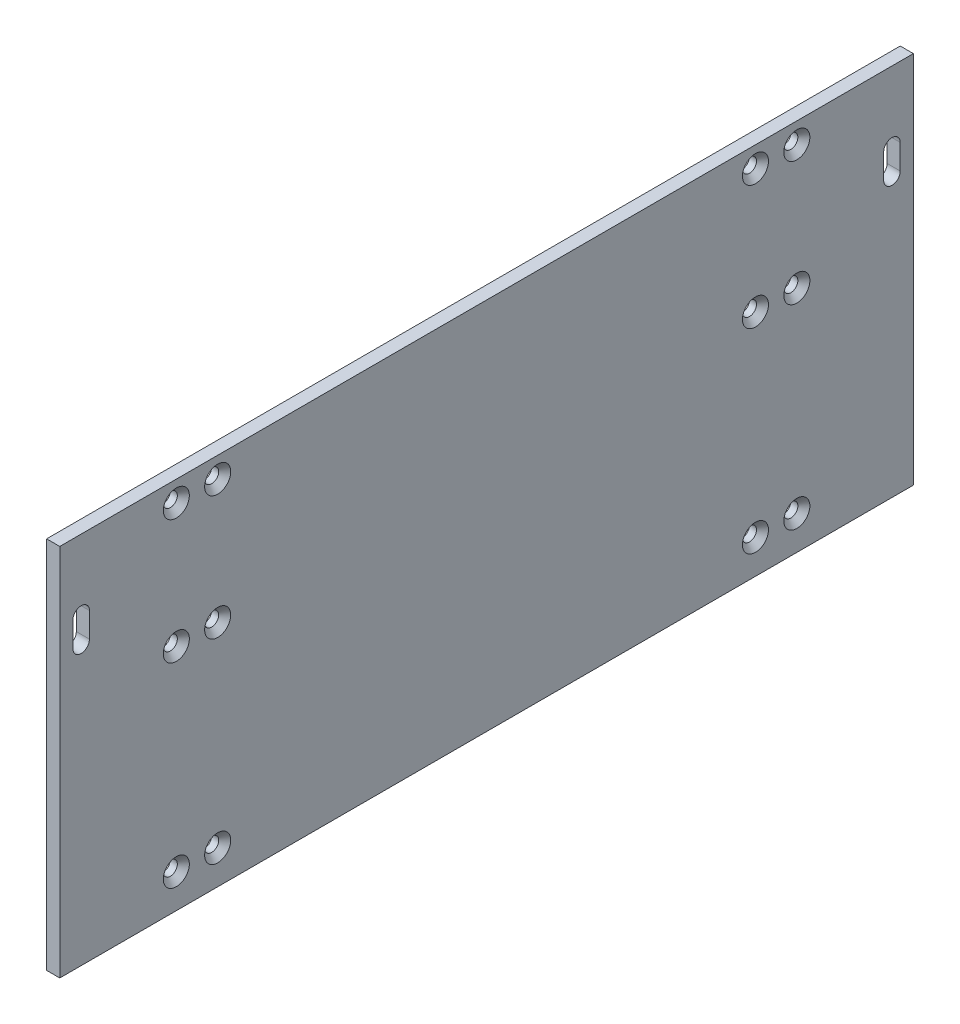
ISO-10303-21;
HEADER;
FILE_DESCRIPTION(('STEP AP214'),'2;1');
FILE_NAME('part.step','',(''),(''),'','','');
FILE_SCHEMA(('AUTOMOTIVE_DESIGN { 1 0 10303 214 1 1 1 1 }'));
ENDSEC;
DATA;
#1=APPLICATION_CONTEXT('core data for automotive mechanical design processes');
#2=APPLICATION_PROTOCOL_DEFINITION('international standard','automotive_design',2000,#1);
#3=PRODUCT_CONTEXT('',#1,'mechanical');
#4=PRODUCT('Part','Part','',(#3));
#5=PRODUCT_RELATED_PRODUCT_CATEGORY('part','',(#4));
#6=PRODUCT_DEFINITION_FORMATION('','',#4);
#7=PRODUCT_DEFINITION_CONTEXT('part definition',#1,'design');
#8=PRODUCT_DEFINITION('design','',#6,#7);
#9=PRODUCT_DEFINITION_SHAPE('','',#8);
#10=(LENGTH_UNIT() NAMED_UNIT(*) SI_UNIT(.MILLI.,.METRE.));
#11=(NAMED_UNIT(*) PLANE_ANGLE_UNIT() SI_UNIT($,.RADIAN.));
#12=(NAMED_UNIT(*) SI_UNIT($,.STERADIAN.) SOLID_ANGLE_UNIT());
#13=UNCERTAINTY_MEASURE_WITH_UNIT(LENGTH_MEASURE(1.E-05),#10,'distance_accuracy_value','');
#14=(GEOMETRIC_REPRESENTATION_CONTEXT(3) GLOBAL_UNCERTAINTY_ASSIGNED_CONTEXT((#13)) GLOBAL_UNIT_ASSIGNED_CONTEXT((#10,
#11,#12)) REPRESENTATION_CONTEXT('',''));
#15=CARTESIAN_POINT('',(0.,0.,0.));
#16=DIRECTION('',(0.,0.,1.));
#17=DIRECTION('',(1.,0.,0.));
#18=AXIS2_PLACEMENT_3D('',#15,#16,#17);
#19=CARTESIAN_POINT('',(3.175,0.,103.175));
#20=DIRECTION('',(0.,1.,0.));
#21=DIRECTION('',(0.,0.,1.));
#22=AXIS2_PLACEMENT_3D('',#19,#20,#21);
#23=PLANE('',#22);
#24=DIRECTION('',(0.,0.,-1.));
#25=VECTOR('',#24,1.);
#26=CARTESIAN_POINT('',(0.,0.,103.175));
#27=LINE('',#26,#25);
#28=CARTESIAN_POINT('',(0.,0.,103.175));
#29=VERTEX_POINT('',#28);
#30=CARTESIAN_POINT('',(0.,0.,-103.175));
#31=VERTEX_POINT('',#30);
#32=EDGE_CURVE('E296',#29,#31,#27,.T.);
#33=ORIENTED_EDGE('',*,*,#32,.T.);
#34=DIRECTION('',(-1.,0.,0.));
#35=VECTOR('',#34,1.);
#36=CARTESIAN_POINT('',(3.175,0.,-103.175));
#37=LINE('',#36,#35);
#38=CARTESIAN_POINT('',(3.175,0.,-103.175));
#39=VERTEX_POINT('',#38);
#40=EDGE_CURVE('E39',#39,#31,#37,.T.);
#41=ORIENTED_EDGE('',*,*,#40,.F.);
#42=DIRECTION('',(0.,0.,-1.));
#43=VECTOR('',#42,1.);
#44=CARTESIAN_POINT('',(3.175,0.,103.175));
#45=LINE('',#44,#43);
#46=CARTESIAN_POINT('',(3.175,0.,103.175));
#47=VERTEX_POINT('',#46);
#48=EDGE_CURVE('E300',#47,#39,#45,.T.);
#49=ORIENTED_EDGE('',*,*,#48,.F.);
#50=DIRECTION('',(-1.,0.,0.));
#51=VECTOR('',#50,1.);
#52=CARTESIAN_POINT('',(3.175,0.,103.175));
#53=LINE('',#52,#51);
#54=EDGE_CURVE('E11',#47,#29,#53,.T.);
#55=ORIENTED_EDGE('',*,*,#54,.T.);
#56=EDGE_LOOP('',(#33,#41,#49,#55));
#57=FACE_BOUND('',#56,.T.);
#58=ADVANCED_FACE('F32',(#57),#23,.F.);
#59=CARTESIAN_POINT('',(3.175,60.35,-103.175));
#60=DIRECTION('',(0.,0.,1.));
#61=DIRECTION('',(1.,0.,0.));
#62=AXIS2_PLACEMENT_3D('',#59,#60,#61);
#63=PLANE('',#62);
#64=DIRECTION('',(0.,1.,0.));
#65=VECTOR('',#64,1.);
#66=CARTESIAN_POINT('',(0.,60.35,-103.175));
#67=LINE('',#66,#65);
#68=CARTESIAN_POINT('',(0.,90.35,-103.175));
#69=VERTEX_POINT('',#68);
#70=EDGE_CURVE('E311',#31,#69,#67,.T.);
#71=ORIENTED_EDGE('',*,*,#70,.T.);
#72=DIRECTION('',(-1.,0.,0.));
#73=VECTOR('',#72,1.);
#74=CARTESIAN_POINT('',(3.175,90.35,-103.175));
#75=LINE('',#74,#73);
#76=CARTESIAN_POINT('',(3.175,90.35,-103.175));
#77=VERTEX_POINT('',#76);
#78=EDGE_CURVE('E319',#77,#69,#75,.T.);
#79=ORIENTED_EDGE('',*,*,#78,.F.);
#80=DIRECTION('',(0.,1.,0.));
#81=VECTOR('',#80,1.);
#82=CARTESIAN_POINT('',(3.175,0.,-103.175));
#83=LINE('',#82,#81);
#84=EDGE_CURVE('E303',#39,#77,#83,.T.);
#85=ORIENTED_EDGE('',*,*,#84,.F.);
#86=ORIENTED_EDGE('',*,*,#40,.T.);
#87=EDGE_LOOP('',(#71,#79,#85,#86));
#88=FACE_BOUND('',#87,.T.);
#89=ADVANCED_FACE('F325',(#88),#63,.F.);
#90=CARTESIAN_POINT('',(3.175,90.35,103.175));
#91=DIRECTION('',(0.,-1.,0.));
#92=DIRECTION('',(0.,0.,-1.));
#93=AXIS2_PLACEMENT_3D('',#90,#91,#92);
#94=PLANE('',#93);
#95=DIRECTION('',(0.,0.,1.));
#96=VECTOR('',#95,1.);
#97=CARTESIAN_POINT('',(0.,90.35,103.175));
#98=LINE('',#97,#96);
#99=CARTESIAN_POINT('',(0.,90.35,103.175));
#100=VERTEX_POINT('',#99);
#101=EDGE_CURVE('E313',#69,#100,#98,.T.);
#102=ORIENTED_EDGE('',*,*,#101,.T.);
#103=DIRECTION('',(-1.,0.,0.));
#104=VECTOR('',#103,1.);
#105=CARTESIAN_POINT('',(3.175,90.35,103.175));
#106=LINE('',#105,#104);
#107=CARTESIAN_POINT('',(3.175,90.35,103.175));
#108=VERTEX_POINT('',#107);
#109=EDGE_CURVE('E308',#108,#100,#106,.T.);
#110=ORIENTED_EDGE('',*,*,#109,.F.);
#111=DIRECTION('',(0.,0.,1.));
#112=VECTOR('',#111,1.);
#113=CARTESIAN_POINT('',(3.175,90.35,103.175));
#114=LINE('',#113,#112);
#115=EDGE_CURVE('E305',#77,#108,#114,.T.);
#116=ORIENTED_EDGE('',*,*,#115,.F.);
#117=ORIENTED_EDGE('',*,*,#78,.T.);
#118=EDGE_LOOP('',(#102,#110,#116,#117));
#119=FACE_BOUND('',#118,.T.);
#120=ADVANCED_FACE('F334',(#119),#94,.F.);
#121=CARTESIAN_POINT('',(3.175,3.175,103.175));
#122=DIRECTION('',(0.,0.,-1.));
#123=DIRECTION('',(-1.,0.,0.));
#124=AXIS2_PLACEMENT_3D('',#121,#122,#123);
#125=PLANE('',#124);
#126=DIRECTION('',(0.,-1.,0.));
#127=VECTOR('',#126,1.);
#128=CARTESIAN_POINT('',(0.,3.175,103.175));
#129=LINE('',#128,#127);
#130=EDGE_CURVE('E301',#100,#29,#129,.T.);
#131=ORIENTED_EDGE('',*,*,#130,.T.);
#132=ORIENTED_EDGE('',*,*,#54,.F.);
#133=DIRECTION('',(0.,-1.,0.));
#134=VECTOR('',#133,1.);
#135=CARTESIAN_POINT('',(3.175,3.175,103.175));
#136=LINE('',#135,#134);
#137=EDGE_CURVE('E297',#108,#47,#136,.T.);
#138=ORIENTED_EDGE('',*,*,#137,.F.);
#139=ORIENTED_EDGE('',*,*,#109,.T.);
#140=EDGE_LOOP('',(#131,#132,#138,#139));
#141=FACE_BOUND('',#140,.T.);
#142=ADVANCED_FACE('F337',(#141),#125,.F.);
#143=CARTESIAN_POINT('',(3.175,0.,103.175));
#144=DIRECTION('',(1.,0.,0.));
#145=DIRECTION('',(0.,0.,-1.));
#146=AXIS2_PLACEMENT_3D('',#143,#144,#145);
#147=PLANE('',#146);
#148=CARTESIAN_POINT('',(3.175,73.35,-98.));
#149=DIRECTION('',(1.,0.,0.));
#150=DIRECTION('',(0.,0.,1.));
#151=AXIS2_PLACEMENT_3D('',#148,#149,#150);
#152=CIRCLE('',#151,2.00000000000003);
#153=CARTESIAN_POINT('',(3.175,73.35,-100.));
#154=VERTEX_POINT('',#153);
#155=CARTESIAN_POINT('',(3.175,73.35,-95.9999999999999));
#156=VERTEX_POINT('',#155);
#157=EDGE_CURVE('E46',#154,#156,#152,.T.);
#158=ORIENTED_EDGE('',*,*,#157,.F.);
#159=DIRECTION('',(0.,1.,0.));
#160=VECTOR('',#159,1.);
#161=CARTESIAN_POINT('',(3.175,73.35,-100.));
#162=LINE('',#161,#160);
#163=CARTESIAN_POINT('',(3.175,67.35,-100.));
#164=VERTEX_POINT('',#163);
#165=EDGE_CURVE('E138',#164,#154,#162,.T.);
#166=ORIENTED_EDGE('',*,*,#165,.F.);
#167=CARTESIAN_POINT('',(3.175,67.35,-98.));
#168=DIRECTION('',(1.,0.,0.));
#169=DIRECTION('',(0.,0.,1.));
#170=AXIS2_PLACEMENT_3D('',#167,#168,#169);
#171=CIRCLE('',#170,2.00000000000003);
#172=CARTESIAN_POINT('',(3.175,67.35,-95.9999999999999));
#173=VERTEX_POINT('',#172);
#174=EDGE_CURVE('E141',#173,#164,#171,.T.);
#175=ORIENTED_EDGE('',*,*,#174,.F.);
#176=DIRECTION('',(0.,-1.,0.));
#177=VECTOR('',#176,1.);
#178=CARTESIAN_POINT('',(3.175,73.35,-95.9999999999999));
#179=LINE('',#178,#177);
#180=EDGE_CURVE('E147',#156,#173,#179,.T.);
#181=ORIENTED_EDGE('',*,*,#180,.F.);
#182=EDGE_LOOP('',(#158,#166,#175,#181));
#183=FACE_BOUND('',#182,.T.);
#184=CARTESIAN_POINT('',(3.175,73.35,98.));
#185=DIRECTION('',(1.,0.,0.));
#186=DIRECTION('',(0.,0.,-1.));
#187=AXIS2_PLACEMENT_3D('',#184,#185,#186);
#188=CIRCLE('',#187,2.00000000000003);
#189=CARTESIAN_POINT('',(3.175,73.35,95.9999999999999));
#190=VERTEX_POINT('',#189);
#191=CARTESIAN_POINT('',(3.175,73.35,100.));
#192=VERTEX_POINT('',#191);
#193=EDGE_CURVE('E153',#190,#192,#188,.T.);
#194=ORIENTED_EDGE('',*,*,#193,.F.);
#195=DIRECTION('',(0.,1.,0.));
#196=VECTOR('',#195,1.);
#197=CARTESIAN_POINT('',(3.175,73.35,95.9999999999999));
#198=LINE('',#197,#196);
#199=CARTESIAN_POINT('',(3.175,67.35,95.9999999999999));
#200=VERTEX_POINT('',#199);
#201=EDGE_CURVE('E161',#200,#190,#198,.T.);
#202=ORIENTED_EDGE('',*,*,#201,.F.);
#203=CARTESIAN_POINT('',(3.175,67.35,98.));
#204=DIRECTION('',(1.,0.,0.));
#205=DIRECTION('',(0.,0.,-1.));
#206=AXIS2_PLACEMENT_3D('',#203,#204,#205);
#207=CIRCLE('',#206,2.00000000000003);
#208=CARTESIAN_POINT('',(3.175,67.35,100.));
#209=VERTEX_POINT('',#208);
#210=EDGE_CURVE('E175',#209,#200,#207,.T.);
#211=ORIENTED_EDGE('',*,*,#210,.F.);
#212=DIRECTION('',(0.,-1.,0.));
#213=VECTOR('',#212,1.);
#214=CARTESIAN_POINT('',(3.175,73.35,100.));
#215=LINE('',#214,#213);
#216=EDGE_CURVE('E172',#192,#209,#215,.T.);
#217=ORIENTED_EDGE('',*,*,#216,.F.);
#218=EDGE_LOOP('',(#194,#202,#211,#217));
#219=FACE_BOUND('',#218,.T.);
#220=CARTESIAN_POINT('',(3.175,8.175,-75.));
#221=DIRECTION('',(1.,0.,0.));
#222=DIRECTION('',(0.,0.,-1.));
#223=AXIS2_PLACEMENT_3D('',#220,#221,#222);
#224=CIRCLE('',#223,3.15);
#225=CARTESIAN_POINT('',(3.175,8.175,-78.15));
#226=VERTEX_POINT('',#225);
#227=EDGE_CURVE('E182',#226,#226,#224,.T.);
#228=ORIENTED_EDGE('',*,*,#227,.F.);
#229=EDGE_LOOP('',(#228));
#230=FACE_BOUND('',#229,.T.);
#231=CARTESIAN_POINT('',(3.175,8.175,-65.));
#232=DIRECTION('',(1.,0.,0.));
#233=DIRECTION('',(0.,0.,-1.));
#234=AXIS2_PLACEMENT_3D('',#231,#232,#233);
#235=CIRCLE('',#234,3.15);
#236=CARTESIAN_POINT('',(3.175,8.175,-68.15));
#237=VERTEX_POINT('',#236);
#238=EDGE_CURVE('E197',#237,#237,#235,.T.);
#239=ORIENTED_EDGE('',*,*,#238,.F.);
#240=EDGE_LOOP('',(#239));
#241=FACE_BOUND('',#240,.T.);
#242=CARTESIAN_POINT('',(3.175,55.35,-75.));
#243=DIRECTION('',(1.,0.,0.));
#244=DIRECTION('',(0.,0.,-1.));
#245=AXIS2_PLACEMENT_3D('',#242,#243,#244);
#246=CIRCLE('',#245,3.15);
#247=CARTESIAN_POINT('',(3.175,55.35,-78.15));
#248=VERTEX_POINT('',#247);
#249=EDGE_CURVE('E206',#248,#248,#246,.T.);
#250=ORIENTED_EDGE('',*,*,#249,.F.);
#251=EDGE_LOOP('',(#250));
#252=FACE_BOUND('',#251,.T.);
#253=CARTESIAN_POINT('',(3.175,55.35,-65.));
#254=DIRECTION('',(1.,0.,0.));
#255=DIRECTION('',(0.,0.,-1.));
#256=AXIS2_PLACEMENT_3D('',#253,#254,#255);
#257=CIRCLE('',#256,3.15);
#258=CARTESIAN_POINT('',(3.175,55.35,-68.15));
#259=VERTEX_POINT('',#258);
#260=EDGE_CURVE('E215',#259,#259,#257,.T.);
#261=ORIENTED_EDGE('',*,*,#260,.F.);
#262=EDGE_LOOP('',(#261));
#263=FACE_BOUND('',#262,.T.);
#264=CARTESIAN_POINT('',(3.175,85.35,-75.));
#265=DIRECTION('',(1.,0.,0.));
#266=DIRECTION('',(0.,0.,-1.));
#267=AXIS2_PLACEMENT_3D('',#264,#265,#266);
#268=CIRCLE('',#267,3.15);
#269=CARTESIAN_POINT('',(3.175,85.35,-78.15));
#270=VERTEX_POINT('',#269);
#271=EDGE_CURVE('E224',#270,#270,#268,.T.);
#272=ORIENTED_EDGE('',*,*,#271,.F.);
#273=EDGE_LOOP('',(#272));
#274=FACE_BOUND('',#273,.T.);
#275=CARTESIAN_POINT('',(3.175,85.35,-65.));
#276=DIRECTION('',(1.,0.,0.));
#277=DIRECTION('',(0.,0.,-1.));
#278=AXIS2_PLACEMENT_3D('',#275,#276,#277);
#279=CIRCLE('',#278,3.15);
#280=CARTESIAN_POINT('',(3.175,85.35,-68.15));
#281=VERTEX_POINT('',#280);
#282=EDGE_CURVE('E233',#281,#281,#279,.T.);
#283=ORIENTED_EDGE('',*,*,#282,.F.);
#284=EDGE_LOOP('',(#283));
#285=FACE_BOUND('',#284,.T.);
#286=CARTESIAN_POINT('',(3.175,8.175,75.));
#287=DIRECTION('',(1.,0.,0.));
#288=DIRECTION('',(0.,0.,-1.));
#289=AXIS2_PLACEMENT_3D('',#286,#287,#288);
#290=CIRCLE('',#289,3.15);
#291=CARTESIAN_POINT('',(3.175,8.175,71.85));
#292=VERTEX_POINT('',#291);
#293=EDGE_CURVE('E242',#292,#292,#290,.T.);
#294=ORIENTED_EDGE('',*,*,#293,.F.);
#295=EDGE_LOOP('',(#294));
#296=FACE_BOUND('',#295,.T.);
#297=CARTESIAN_POINT('',(3.175,8.175,65.));
#298=DIRECTION('',(1.,0.,0.));
#299=DIRECTION('',(0.,0.,-1.));
#300=AXIS2_PLACEMENT_3D('',#297,#298,#299);
#301=CIRCLE('',#300,3.15);
#302=CARTESIAN_POINT('',(3.175,8.175,61.85));
#303=VERTEX_POINT('',#302);
#304=EDGE_CURVE('E251',#303,#303,#301,.T.);
#305=ORIENTED_EDGE('',*,*,#304,.F.);
#306=EDGE_LOOP('',(#305));
#307=FACE_BOUND('',#306,.T.);
#308=CARTESIAN_POINT('',(3.175,55.35,75.));
#309=DIRECTION('',(1.,0.,0.));
#310=DIRECTION('',(0.,0.,-1.));
#311=AXIS2_PLACEMENT_3D('',#308,#309,#310);
#312=CIRCLE('',#311,3.15);
#313=CARTESIAN_POINT('',(3.175,55.35,71.85));
#314=VERTEX_POINT('',#313);
#315=EDGE_CURVE('E260',#314,#314,#312,.T.);
#316=ORIENTED_EDGE('',*,*,#315,.F.);
#317=EDGE_LOOP('',(#316));
#318=FACE_BOUND('',#317,.T.);
#319=CARTESIAN_POINT('',(3.175,55.35,65.));
#320=DIRECTION('',(1.,0.,0.));
#321=DIRECTION('',(0.,0.,-1.));
#322=AXIS2_PLACEMENT_3D('',#319,#320,#321);
#323=CIRCLE('',#322,3.15);
#324=CARTESIAN_POINT('',(3.175,55.35,61.85));
#325=VERTEX_POINT('',#324);
#326=EDGE_CURVE('E269',#325,#325,#323,.T.);
#327=ORIENTED_EDGE('',*,*,#326,.F.);
#328=EDGE_LOOP('',(#327));
#329=FACE_BOUND('',#328,.T.);
#330=CARTESIAN_POINT('',(3.175,85.35,75.));
#331=DIRECTION('',(1.,0.,0.));
#332=DIRECTION('',(0.,0.,-1.));
#333=AXIS2_PLACEMENT_3D('',#330,#331,#332);
#334=CIRCLE('',#333,3.15);
#335=CARTESIAN_POINT('',(3.175,85.35,71.85));
#336=VERTEX_POINT('',#335);
#337=EDGE_CURVE('E278',#336,#336,#334,.T.);
#338=ORIENTED_EDGE('',*,*,#337,.F.);
#339=EDGE_LOOP('',(#338));
#340=FACE_BOUND('',#339,.T.);
#341=CARTESIAN_POINT('',(3.175,85.35,65.));
#342=DIRECTION('',(1.,0.,0.));
#343=DIRECTION('',(0.,0.,-1.));
#344=AXIS2_PLACEMENT_3D('',#341,#342,#343);
#345=CIRCLE('',#344,3.15);
#346=CARTESIAN_POINT('',(3.175,85.35,61.85));
#347=VERTEX_POINT('',#346);
#348=EDGE_CURVE('E287',#347,#347,#345,.T.);
#349=ORIENTED_EDGE('',*,*,#348,.F.);
#350=EDGE_LOOP('',(#349));
#351=FACE_BOUND('',#350,.T.);
#352=ORIENTED_EDGE('',*,*,#137,.T.);
#353=ORIENTED_EDGE('',*,*,#48,.T.);
#354=ORIENTED_EDGE('',*,*,#84,.T.);
#355=ORIENTED_EDGE('',*,*,#115,.T.);
#356=EDGE_LOOP('',(#352,#353,#354,#355));
#357=FACE_BOUND('',#356,.T.);
#358=ADVANCED_FACE('F339',(#183,#219,#230,#241,#252,#263,#274,#285,#296,#307,#318,#329,#340,
#351,#357),#147,.T.);
#359=CARTESIAN_POINT('',(0.,0.,103.175));
#360=DIRECTION('',(1.,0.,0.));
#361=DIRECTION('',(0.,0.,-1.));
#362=AXIS2_PLACEMENT_3D('',#359,#360,#361);
#363=PLANE('',#362);
#364=DIRECTION('',(0.,1.,0.));
#365=VECTOR('',#364,1.);
#366=CARTESIAN_POINT('',(0.,73.35,-100.));
#367=LINE('',#366,#365);
#368=CARTESIAN_POINT('',(0.,67.35,-100.));
#369=VERTEX_POINT('',#368);
#370=CARTESIAN_POINT('',(0.,73.35,-100.));
#371=VERTEX_POINT('',#370);
#372=EDGE_CURVE('E128',#369,#371,#367,.T.);
#373=ORIENTED_EDGE('',*,*,#372,.T.);
#374=CARTESIAN_POINT('',(0.,73.35,-98.));
#375=DIRECTION('',(1.,0.,0.));
#376=DIRECTION('',(0.,0.,1.));
#377=AXIS2_PLACEMENT_3D('',#374,#375,#376);
#378=CIRCLE('',#377,2.00000000000003);
#379=CARTESIAN_POINT('',(0.,73.35,-95.9999999999999));
#380=VERTEX_POINT('',#379);
#381=EDGE_CURVE('E122',#371,#380,#378,.T.);
#382=ORIENTED_EDGE('',*,*,#381,.T.);
#383=DIRECTION('',(0.,-1.,0.));
#384=VECTOR('',#383,1.);
#385=CARTESIAN_POINT('',(0.,73.35,-95.9999999999999));
#386=LINE('',#385,#384);
#387=CARTESIAN_POINT('',(0.,67.35,-95.9999999999999));
#388=VERTEX_POINT('',#387);
#389=EDGE_CURVE('E131',#380,#388,#386,.T.);
#390=ORIENTED_EDGE('',*,*,#389,.T.);
#391=CARTESIAN_POINT('',(0.,67.35,-98.));
#392=DIRECTION('',(1.,0.,0.));
#393=DIRECTION('',(0.,0.,1.));
#394=AXIS2_PLACEMENT_3D('',#391,#392,#393);
#395=CIRCLE('',#394,2.00000000000003);
#396=EDGE_CURVE('E54',#388,#369,#395,.T.);
#397=ORIENTED_EDGE('',*,*,#396,.T.);
#398=EDGE_LOOP('',(#373,#382,#390,#397));
#399=FACE_BOUND('',#398,.T.);
#400=DIRECTION('',(0.,1.,0.));
#401=VECTOR('',#400,1.);
#402=CARTESIAN_POINT('',(0.,73.35,95.9999999999999));
#403=LINE('',#402,#401);
#404=CARTESIAN_POINT('',(0.,67.35,95.9999999999999));
#405=VERTEX_POINT('',#404);
#406=CARTESIAN_POINT('',(0.,73.35,95.9999999999999));
#407=VERTEX_POINT('',#406);
#408=EDGE_CURVE('E167',#405,#407,#403,.T.);
#409=ORIENTED_EDGE('',*,*,#408,.T.);
#410=CARTESIAN_POINT('',(0.,73.35,98.));
#411=DIRECTION('',(1.,0.,0.));
#412=DIRECTION('',(0.,0.,-1.));
#413=AXIS2_PLACEMENT_3D('',#410,#411,#412);
#414=CIRCLE('',#413,2.00000000000003);
#415=CARTESIAN_POINT('',(0.,73.35,100.));
#416=VERTEX_POINT('',#415);
#417=EDGE_CURVE('E157',#407,#416,#414,.T.);
#418=ORIENTED_EDGE('',*,*,#417,.T.);
#419=DIRECTION('',(0.,-1.,0.));
#420=VECTOR('',#419,1.);
#421=CARTESIAN_POINT('',(0.,73.35,100.));
#422=LINE('',#421,#420);
#423=CARTESIAN_POINT('',(0.,67.35,100.));
#424=VERTEX_POINT('',#423);
#425=EDGE_CURVE('E160',#416,#424,#422,.T.);
#426=ORIENTED_EDGE('',*,*,#425,.T.);
#427=CARTESIAN_POINT('',(0.,67.35,98.));
#428=DIRECTION('',(1.,0.,0.));
#429=DIRECTION('',(0.,0.,-1.));
#430=AXIS2_PLACEMENT_3D('',#427,#428,#429);
#431=CIRCLE('',#430,2.00000000000003);
#432=EDGE_CURVE('E164',#424,#405,#431,.T.);
#433=ORIENTED_EDGE('',*,*,#432,.T.);
#434=EDGE_LOOP('',(#409,#418,#426,#433));
#435=FACE_BOUND('',#434,.T.);
#436=CARTESIAN_POINT('',(0.,8.175,-75.));
#437=DIRECTION('',(1.,0.,0.));
#438=DIRECTION('',(0.,0.,-1.));
#439=AXIS2_PLACEMENT_3D('',#436,#437,#438);
#440=CIRCLE('',#439,1.7);
#441=CARTESIAN_POINT('',(0.,8.175,-76.7));
#442=VERTEX_POINT('',#441);
#443=EDGE_CURVE('E194',#442,#442,#440,.T.);
#444=ORIENTED_EDGE('',*,*,#443,.T.);
#445=EDGE_LOOP('',(#444));
#446=FACE_BOUND('',#445,.T.);
#447=CARTESIAN_POINT('',(0.,8.175,-65.));
#448=DIRECTION('',(1.,0.,0.));
#449=DIRECTION('',(0.,0.,-1.));
#450=AXIS2_PLACEMENT_3D('',#447,#448,#449);
#451=CIRCLE('',#450,1.7);
#452=CARTESIAN_POINT('',(0.,8.175,-66.7));
#453=VERTEX_POINT('',#452);
#454=EDGE_CURVE('E203',#453,#453,#451,.T.);
#455=ORIENTED_EDGE('',*,*,#454,.T.);
#456=EDGE_LOOP('',(#455));
#457=FACE_BOUND('',#456,.T.);
#458=CARTESIAN_POINT('',(0.,55.35,-75.));
#459=DIRECTION('',(1.,0.,0.));
#460=DIRECTION('',(0.,0.,-1.));
#461=AXIS2_PLACEMENT_3D('',#458,#459,#460);
#462=CIRCLE('',#461,1.7);
#463=CARTESIAN_POINT('',(0.,55.35,-76.7));
#464=VERTEX_POINT('',#463);
#465=EDGE_CURVE('E212',#464,#464,#462,.T.);
#466=ORIENTED_EDGE('',*,*,#465,.T.);
#467=EDGE_LOOP('',(#466));
#468=FACE_BOUND('',#467,.T.);
#469=CARTESIAN_POINT('',(0.,55.35,-65.));
#470=DIRECTION('',(1.,0.,0.));
#471=DIRECTION('',(0.,0.,-1.));
#472=AXIS2_PLACEMENT_3D('',#469,#470,#471);
#473=CIRCLE('',#472,1.7);
#474=CARTESIAN_POINT('',(0.,55.35,-66.7));
#475=VERTEX_POINT('',#474);
#476=EDGE_CURVE('E221',#475,#475,#473,.T.);
#477=ORIENTED_EDGE('',*,*,#476,.T.);
#478=EDGE_LOOP('',(#477));
#479=FACE_BOUND('',#478,.T.);
#480=CARTESIAN_POINT('',(0.,85.35,-75.));
#481=DIRECTION('',(1.,0.,0.));
#482=DIRECTION('',(0.,0.,-1.));
#483=AXIS2_PLACEMENT_3D('',#480,#481,#482);
#484=CIRCLE('',#483,1.69999999999999);
#485=CARTESIAN_POINT('',(0.,85.35,-76.7));
#486=VERTEX_POINT('',#485);
#487=EDGE_CURVE('E230',#486,#486,#484,.T.);
#488=ORIENTED_EDGE('',*,*,#487,.T.);
#489=EDGE_LOOP('',(#488));
#490=FACE_BOUND('',#489,.T.);
#491=CARTESIAN_POINT('',(0.,85.35,-65.));
#492=DIRECTION('',(1.,0.,0.));
#493=DIRECTION('',(0.,0.,-1.));
#494=AXIS2_PLACEMENT_3D('',#491,#492,#493);
#495=CIRCLE('',#494,1.69999999999999);
#496=CARTESIAN_POINT('',(0.,85.35,-66.7));
#497=VERTEX_POINT('',#496);
#498=EDGE_CURVE('E239',#497,#497,#495,.T.);
#499=ORIENTED_EDGE('',*,*,#498,.T.);
#500=EDGE_LOOP('',(#499));
#501=FACE_BOUND('',#500,.T.);
#502=CARTESIAN_POINT('',(0.,8.175,75.));
#503=DIRECTION('',(1.,0.,0.));
#504=DIRECTION('',(0.,0.,-1.));
#505=AXIS2_PLACEMENT_3D('',#502,#503,#504);
#506=CIRCLE('',#505,1.7);
#507=CARTESIAN_POINT('',(0.,8.175,73.3));
#508=VERTEX_POINT('',#507);
#509=EDGE_CURVE('E248',#508,#508,#506,.T.);
#510=ORIENTED_EDGE('',*,*,#509,.T.);
#511=EDGE_LOOP('',(#510));
#512=FACE_BOUND('',#511,.T.);
#513=CARTESIAN_POINT('',(0.,8.175,65.));
#514=DIRECTION('',(1.,0.,0.));
#515=DIRECTION('',(0.,0.,-1.));
#516=AXIS2_PLACEMENT_3D('',#513,#514,#515);
#517=CIRCLE('',#516,1.7);
#518=CARTESIAN_POINT('',(0.,8.175,63.3));
#519=VERTEX_POINT('',#518);
#520=EDGE_CURVE('E257',#519,#519,#517,.T.);
#521=ORIENTED_EDGE('',*,*,#520,.T.);
#522=EDGE_LOOP('',(#521));
#523=FACE_BOUND('',#522,.T.);
#524=CARTESIAN_POINT('',(0.,55.35,75.));
#525=DIRECTION('',(1.,0.,0.));
#526=DIRECTION('',(0.,0.,-1.));
#527=AXIS2_PLACEMENT_3D('',#524,#525,#526);
#528=CIRCLE('',#527,1.7);
#529=CARTESIAN_POINT('',(0.,55.35,73.3));
#530=VERTEX_POINT('',#529);
#531=EDGE_CURVE('E266',#530,#530,#528,.T.);
#532=ORIENTED_EDGE('',*,*,#531,.T.);
#533=EDGE_LOOP('',(#532));
#534=FACE_BOUND('',#533,.T.);
#535=CARTESIAN_POINT('',(0.,55.35,65.));
#536=DIRECTION('',(1.,0.,0.));
#537=DIRECTION('',(0.,0.,-1.));
#538=AXIS2_PLACEMENT_3D('',#535,#536,#537);
#539=CIRCLE('',#538,1.7);
#540=CARTESIAN_POINT('',(0.,55.35,63.3));
#541=VERTEX_POINT('',#540);
#542=EDGE_CURVE('E275',#541,#541,#539,.T.);
#543=ORIENTED_EDGE('',*,*,#542,.T.);
#544=EDGE_LOOP('',(#543));
#545=FACE_BOUND('',#544,.T.);
#546=CARTESIAN_POINT('',(0.,85.35,75.));
#547=DIRECTION('',(1.,0.,0.));
#548=DIRECTION('',(0.,0.,-1.));
#549=AXIS2_PLACEMENT_3D('',#546,#547,#548);
#550=CIRCLE('',#549,1.69999999999999);
#551=CARTESIAN_POINT('',(0.,85.35,73.3));
#552=VERTEX_POINT('',#551);
#553=EDGE_CURVE('E284',#552,#552,#550,.T.);
#554=ORIENTED_EDGE('',*,*,#553,.T.);
#555=EDGE_LOOP('',(#554));
#556=FACE_BOUND('',#555,.T.);
#557=CARTESIAN_POINT('',(0.,85.35,65.));
#558=DIRECTION('',(1.,0.,0.));
#559=DIRECTION('',(0.,0.,-1.));
#560=AXIS2_PLACEMENT_3D('',#557,#558,#559);
#561=CIRCLE('',#560,1.69999999999999);
#562=CARTESIAN_POINT('',(0.,85.35,63.3));
#563=VERTEX_POINT('',#562);
#564=EDGE_CURVE('E293',#563,#563,#561,.T.);
#565=ORIENTED_EDGE('',*,*,#564,.T.);
#566=EDGE_LOOP('',(#565));
#567=FACE_BOUND('',#566,.T.);
#568=ORIENTED_EDGE('',*,*,#32,.F.);
#569=ORIENTED_EDGE('',*,*,#130,.F.);
#570=ORIENTED_EDGE('',*,*,#101,.F.);
#571=ORIENTED_EDGE('',*,*,#70,.F.);
#572=EDGE_LOOP('',(#568,#569,#570,#571));
#573=FACE_BOUND('',#572,.T.);
#574=ADVANCED_FACE('F135',(#399,#435,#446,#457,#468,#479,#490,#501,#512,#523,#534,#545,#556,
#567,#573),#363,.F.);
#575=CARTESIAN_POINT('',(3.175,85.35,65.));
#576=DIRECTION('',(1.,0.,0.));
#577=DIRECTION('',(0.,0.,-1.));
#578=AXIS2_PLACEMENT_3D('',#575,#576,#577);
#579=CYLINDRICAL_SURFACE('',#578,1.69999999999999);
#580=ORIENTED_EDGE('',*,*,#564,.F.);
#581=EDGE_LOOP('',(#580));
#582=FACE_BOUND('',#581,.T.);
#583=CARTESIAN_POINT('',(1.72499999999999,85.35,65.));
#584=DIRECTION('',(1.,0.,0.));
#585=DIRECTION('',(0.,0.,-1.));
#586=AXIS2_PLACEMENT_3D('',#583,#584,#585);
#587=CIRCLE('',#586,1.69999999999999);
#588=CARTESIAN_POINT('',(1.72499999999999,85.35,63.3));
#589=VERTEX_POINT('',#588);
#590=EDGE_CURVE('E290',#589,#589,#587,.T.);
#591=ORIENTED_EDGE('',*,*,#590,.T.);
#592=EDGE_LOOP('',(#591));
#593=FACE_BOUND('',#592,.T.);
#594=ADVANCED_FACE('F347',(#582,#593),#579,.F.);
#595=CARTESIAN_POINT('',(3.175,85.35,65.));
#596=DIRECTION('',(1.,0.,0.));
#597=DIRECTION('',(0.,0.,-1.));
#598=AXIS2_PLACEMENT_3D('',#595,#596,#597);
#599=CONICAL_SURFACE('',#598,3.15,0.785398163397448);
#600=ORIENTED_EDGE('',*,*,#590,.F.);
#601=EDGE_LOOP('',(#600));
#602=FACE_BOUND('',#601,.T.);
#603=ORIENTED_EDGE('',*,*,#348,.T.);
#604=EDGE_LOOP('',(#603));
#605=FACE_BOUND('',#604,.T.);
#606=ADVANCED_FACE('F377',(#602,#605),#599,.F.);
#607=CARTESIAN_POINT('',(3.175,85.35,75.));
#608=DIRECTION('',(1.,0.,0.));
#609=DIRECTION('',(0.,0.,-1.));
#610=AXIS2_PLACEMENT_3D('',#607,#608,#609);
#611=CYLINDRICAL_SURFACE('',#610,1.69999999999999);
#612=ORIENTED_EDGE('',*,*,#553,.F.);
#613=EDGE_LOOP('',(#612));
#614=FACE_BOUND('',#613,.T.);
#615=CARTESIAN_POINT('',(1.72499999999999,85.35,75.));
#616=DIRECTION('',(1.,0.,0.));
#617=DIRECTION('',(0.,0.,-1.));
#618=AXIS2_PLACEMENT_3D('',#615,#616,#617);
#619=CIRCLE('',#618,1.69999999999999);
#620=CARTESIAN_POINT('',(1.72499999999999,85.35,73.3));
#621=VERTEX_POINT('',#620);
#622=EDGE_CURVE('E281',#621,#621,#619,.T.);
#623=ORIENTED_EDGE('',*,*,#622,.T.);
#624=EDGE_LOOP('',(#623));
#625=FACE_BOUND('',#624,.T.);
#626=ADVANCED_FACE('F387',(#614,#625),#611,.F.);
#627=CARTESIAN_POINT('',(3.175,85.35,75.));
#628=DIRECTION('',(1.,0.,0.));
#629=DIRECTION('',(0.,0.,-1.));
#630=AXIS2_PLACEMENT_3D('',#627,#628,#629);
#631=CONICAL_SURFACE('',#630,3.15,0.785398163397448);
#632=ORIENTED_EDGE('',*,*,#622,.F.);
#633=EDGE_LOOP('',(#632));
#634=FACE_BOUND('',#633,.T.);
#635=ORIENTED_EDGE('',*,*,#337,.T.);
#636=EDGE_LOOP('',(#635));
#637=FACE_BOUND('',#636,.T.);
#638=ADVANCED_FACE('F397',(#634,#637),#631,.F.);
#639=CARTESIAN_POINT('',(3.175,55.35,65.));
#640=DIRECTION('',(1.,0.,0.));
#641=DIRECTION('',(0.,0.,-1.));
#642=AXIS2_PLACEMENT_3D('',#639,#640,#641);
#643=CYLINDRICAL_SURFACE('',#642,1.69999999999999);
#644=ORIENTED_EDGE('',*,*,#542,.F.);
#645=EDGE_LOOP('',(#644));
#646=FACE_BOUND('',#645,.T.);
#647=CARTESIAN_POINT('',(1.72499999999999,55.35,65.));
#648=DIRECTION('',(1.,0.,0.));
#649=DIRECTION('',(0.,0.,-1.));
#650=AXIS2_PLACEMENT_3D('',#647,#648,#649);
#651=CIRCLE('',#650,1.69999999999999);
#652=CARTESIAN_POINT('',(1.72499999999999,55.35,63.3));
#653=VERTEX_POINT('',#652);
#654=EDGE_CURVE('E272',#653,#653,#651,.T.);
#655=ORIENTED_EDGE('',*,*,#654,.T.);
#656=EDGE_LOOP('',(#655));
#657=FACE_BOUND('',#656,.T.);
#658=ADVANCED_FACE('F407',(#646,#657),#643,.F.);
#659=CARTESIAN_POINT('',(3.175,55.35,65.));
#660=DIRECTION('',(1.,0.,0.));
#661=DIRECTION('',(0.,0.,-1.));
#662=AXIS2_PLACEMENT_3D('',#659,#660,#661);
#663=CONICAL_SURFACE('',#662,3.15,0.78539816339745);
#664=ORIENTED_EDGE('',*,*,#654,.F.);
#665=EDGE_LOOP('',(#664));
#666=FACE_BOUND('',#665,.T.);
#667=ORIENTED_EDGE('',*,*,#326,.T.);
#668=EDGE_LOOP('',(#667));
#669=FACE_BOUND('',#668,.T.);
#670=ADVANCED_FACE('F417',(#666,#669),#663,.F.);
#671=CARTESIAN_POINT('',(3.175,55.35,75.));
#672=DIRECTION('',(1.,0.,0.));
#673=DIRECTION('',(0.,0.,-1.));
#674=AXIS2_PLACEMENT_3D('',#671,#672,#673);
#675=CYLINDRICAL_SURFACE('',#674,1.69999999999999);
#676=ORIENTED_EDGE('',*,*,#531,.F.);
#677=EDGE_LOOP('',(#676));
#678=FACE_BOUND('',#677,.T.);
#679=CARTESIAN_POINT('',(1.72499999999999,55.35,75.));
#680=DIRECTION('',(1.,0.,0.));
#681=DIRECTION('',(0.,0.,-1.));
#682=AXIS2_PLACEMENT_3D('',#679,#680,#681);
#683=CIRCLE('',#682,1.69999999999999);
#684=CARTESIAN_POINT('',(1.72499999999999,55.35,73.3));
#685=VERTEX_POINT('',#684);
#686=EDGE_CURVE('E263',#685,#685,#683,.T.);
#687=ORIENTED_EDGE('',*,*,#686,.T.);
#688=EDGE_LOOP('',(#687));
#689=FACE_BOUND('',#688,.T.);
#690=ADVANCED_FACE('F427',(#678,#689),#675,.F.);
#691=CARTESIAN_POINT('',(3.175,55.35,75.));
#692=DIRECTION('',(1.,0.,0.));
#693=DIRECTION('',(0.,0.,-1.));
#694=AXIS2_PLACEMENT_3D('',#691,#692,#693);
#695=CONICAL_SURFACE('',#694,3.15,0.78539816339745);
#696=ORIENTED_EDGE('',*,*,#686,.F.);
#697=EDGE_LOOP('',(#696));
#698=FACE_BOUND('',#697,.T.);
#699=ORIENTED_EDGE('',*,*,#315,.T.);
#700=EDGE_LOOP('',(#699));
#701=FACE_BOUND('',#700,.T.);
#702=ADVANCED_FACE('F437',(#698,#701),#695,.F.);
#703=CARTESIAN_POINT('',(3.175,8.175,65.));
#704=DIRECTION('',(1.,0.,0.));
#705=DIRECTION('',(0.,0.,-1.));
#706=AXIS2_PLACEMENT_3D('',#703,#704,#705);
#707=CYLINDRICAL_SURFACE('',#706,1.69999999999999);
#708=ORIENTED_EDGE('',*,*,#520,.F.);
#709=EDGE_LOOP('',(#708));
#710=FACE_BOUND('',#709,.T.);
#711=CARTESIAN_POINT('',(1.72499999999999,8.175,65.));
#712=DIRECTION('',(1.,0.,0.));
#713=DIRECTION('',(0.,0.,-1.));
#714=AXIS2_PLACEMENT_3D('',#711,#712,#713);
#715=CIRCLE('',#714,1.69999999999999);
#716=CARTESIAN_POINT('',(1.72499999999999,8.175,63.3));
#717=VERTEX_POINT('',#716);
#718=EDGE_CURVE('E254',#717,#717,#715,.T.);
#719=ORIENTED_EDGE('',*,*,#718,.T.);
#720=EDGE_LOOP('',(#719));
#721=FACE_BOUND('',#720,.T.);
#722=ADVANCED_FACE('F447',(#710,#721),#707,.F.);
#723=CARTESIAN_POINT('',(3.175,8.175,65.));
#724=DIRECTION('',(1.,0.,0.));
#725=DIRECTION('',(0.,0.,-1.));
#726=AXIS2_PLACEMENT_3D('',#723,#724,#725);
#727=CONICAL_SURFACE('',#726,3.15,0.78539816339745);
#728=ORIENTED_EDGE('',*,*,#718,.F.);
#729=EDGE_LOOP('',(#728));
#730=FACE_BOUND('',#729,.T.);
#731=ORIENTED_EDGE('',*,*,#304,.T.);
#732=EDGE_LOOP('',(#731));
#733=FACE_BOUND('',#732,.T.);
#734=ADVANCED_FACE('F457',(#730,#733),#727,.F.);
#735=CARTESIAN_POINT('',(3.175,8.175,75.));
#736=DIRECTION('',(1.,0.,0.));
#737=DIRECTION('',(0.,0.,-1.));
#738=AXIS2_PLACEMENT_3D('',#735,#736,#737);
#739=CYLINDRICAL_SURFACE('',#738,1.69999999999999);
#740=ORIENTED_EDGE('',*,*,#509,.F.);
#741=EDGE_LOOP('',(#740));
#742=FACE_BOUND('',#741,.T.);
#743=CARTESIAN_POINT('',(1.72499999999999,8.175,75.));
#744=DIRECTION('',(1.,0.,0.));
#745=DIRECTION('',(0.,0.,-1.));
#746=AXIS2_PLACEMENT_3D('',#743,#744,#745);
#747=CIRCLE('',#746,1.69999999999999);
#748=CARTESIAN_POINT('',(1.72499999999999,8.175,73.3));
#749=VERTEX_POINT('',#748);
#750=EDGE_CURVE('E245',#749,#749,#747,.T.);
#751=ORIENTED_EDGE('',*,*,#750,.T.);
#752=EDGE_LOOP('',(#751));
#753=FACE_BOUND('',#752,.T.);
#754=ADVANCED_FACE('F467',(#742,#753),#739,.F.);
#755=CARTESIAN_POINT('',(3.175,8.175,75.));
#756=DIRECTION('',(1.,0.,0.));
#757=DIRECTION('',(0.,0.,-1.));
#758=AXIS2_PLACEMENT_3D('',#755,#756,#757);
#759=CONICAL_SURFACE('',#758,3.15,0.78539816339745);
#760=ORIENTED_EDGE('',*,*,#750,.F.);
#761=EDGE_LOOP('',(#760));
#762=FACE_BOUND('',#761,.T.);
#763=ORIENTED_EDGE('',*,*,#293,.T.);
#764=EDGE_LOOP('',(#763));
#765=FACE_BOUND('',#764,.T.);
#766=ADVANCED_FACE('F477',(#762,#765),#759,.F.);
#767=CARTESIAN_POINT('',(3.175,85.35,-65.));
#768=DIRECTION('',(1.,0.,0.));
#769=DIRECTION('',(0.,0.,-1.));
#770=AXIS2_PLACEMENT_3D('',#767,#768,#769);
#771=CYLINDRICAL_SURFACE('',#770,1.69999999999999);
#772=ORIENTED_EDGE('',*,*,#498,.F.);
#773=EDGE_LOOP('',(#772));
#774=FACE_BOUND('',#773,.T.);
#775=CARTESIAN_POINT('',(1.72499999999999,85.35,-65.));
#776=DIRECTION('',(1.,0.,0.));
#777=DIRECTION('',(0.,0.,-1.));
#778=AXIS2_PLACEMENT_3D('',#775,#776,#777);
#779=CIRCLE('',#778,1.69999999999999);
#780=CARTESIAN_POINT('',(1.72499999999999,85.35,-66.7));
#781=VERTEX_POINT('',#780);
#782=EDGE_CURVE('E236',#781,#781,#779,.T.);
#783=ORIENTED_EDGE('',*,*,#782,.T.);
#784=EDGE_LOOP('',(#783));
#785=FACE_BOUND('',#784,.T.);
#786=ADVANCED_FACE('F487',(#774,#785),#771,.F.);
#787=CARTESIAN_POINT('',(3.175,85.35,-65.));
#788=DIRECTION('',(1.,0.,0.));
#789=DIRECTION('',(0.,0.,-1.));
#790=AXIS2_PLACEMENT_3D('',#787,#788,#789);
#791=CONICAL_SURFACE('',#790,3.15,0.785398163397448);
#792=ORIENTED_EDGE('',*,*,#782,.F.);
#793=EDGE_LOOP('',(#792));
#794=FACE_BOUND('',#793,.T.);
#795=ORIENTED_EDGE('',*,*,#282,.T.);
#796=EDGE_LOOP('',(#795));
#797=FACE_BOUND('',#796,.T.);
#798=ADVANCED_FACE('F497',(#794,#797),#791,.F.);
#799=CARTESIAN_POINT('',(3.175,85.35,-75.));
#800=DIRECTION('',(1.,0.,0.));
#801=DIRECTION('',(0.,0.,-1.));
#802=AXIS2_PLACEMENT_3D('',#799,#800,#801);
#803=CYLINDRICAL_SURFACE('',#802,1.69999999999999);
#804=ORIENTED_EDGE('',*,*,#487,.F.);
#805=EDGE_LOOP('',(#804));
#806=FACE_BOUND('',#805,.T.);
#807=CARTESIAN_POINT('',(1.72499999999999,85.35,-75.));
#808=DIRECTION('',(1.,0.,0.));
#809=DIRECTION('',(0.,0.,-1.));
#810=AXIS2_PLACEMENT_3D('',#807,#808,#809);
#811=CIRCLE('',#810,1.69999999999999);
#812=CARTESIAN_POINT('',(1.72499999999999,85.35,-76.7));
#813=VERTEX_POINT('',#812);
#814=EDGE_CURVE('E227',#813,#813,#811,.T.);
#815=ORIENTED_EDGE('',*,*,#814,.T.);
#816=EDGE_LOOP('',(#815));
#817=FACE_BOUND('',#816,.T.);
#818=ADVANCED_FACE('F507',(#806,#817),#803,.F.);
#819=CARTESIAN_POINT('',(3.175,85.35,-75.));
#820=DIRECTION('',(1.,0.,0.));
#821=DIRECTION('',(0.,0.,-1.));
#822=AXIS2_PLACEMENT_3D('',#819,#820,#821);
#823=CONICAL_SURFACE('',#822,3.15,0.785398163397448);
#824=ORIENTED_EDGE('',*,*,#814,.F.);
#825=EDGE_LOOP('',(#824));
#826=FACE_BOUND('',#825,.T.);
#827=ORIENTED_EDGE('',*,*,#271,.T.);
#828=EDGE_LOOP('',(#827));
#829=FACE_BOUND('',#828,.T.);
#830=ADVANCED_FACE('F517',(#826,#829),#823,.F.);
#831=CARTESIAN_POINT('',(3.175,55.35,-65.));
#832=DIRECTION('',(1.,0.,0.));
#833=DIRECTION('',(0.,0.,-1.));
#834=AXIS2_PLACEMENT_3D('',#831,#832,#833);
#835=CYLINDRICAL_SURFACE('',#834,1.69999999999999);
#836=ORIENTED_EDGE('',*,*,#476,.F.);
#837=EDGE_LOOP('',(#836));
#838=FACE_BOUND('',#837,.T.);
#839=CARTESIAN_POINT('',(1.72499999999999,55.35,-65.));
#840=DIRECTION('',(1.,0.,0.));
#841=DIRECTION('',(0.,0.,-1.));
#842=AXIS2_PLACEMENT_3D('',#839,#840,#841);
#843=CIRCLE('',#842,1.69999999999999);
#844=CARTESIAN_POINT('',(1.72499999999999,55.35,-66.7));
#845=VERTEX_POINT('',#844);
#846=EDGE_CURVE('E218',#845,#845,#843,.T.);
#847=ORIENTED_EDGE('',*,*,#846,.T.);
#848=EDGE_LOOP('',(#847));
#849=FACE_BOUND('',#848,.T.);
#850=ADVANCED_FACE('F527',(#838,#849),#835,.F.);
#851=CARTESIAN_POINT('',(3.175,55.35,-65.));
#852=DIRECTION('',(1.,0.,0.));
#853=DIRECTION('',(0.,0.,-1.));
#854=AXIS2_PLACEMENT_3D('',#851,#852,#853);
#855=CONICAL_SURFACE('',#854,3.15,0.78539816339745);
#856=ORIENTED_EDGE('',*,*,#846,.F.);
#857=EDGE_LOOP('',(#856));
#858=FACE_BOUND('',#857,.T.);
#859=ORIENTED_EDGE('',*,*,#260,.T.);
#860=EDGE_LOOP('',(#859));
#861=FACE_BOUND('',#860,.T.);
#862=ADVANCED_FACE('F537',(#858,#861),#855,.F.);
#863=CARTESIAN_POINT('',(3.175,55.35,-75.));
#864=DIRECTION('',(1.,0.,0.));
#865=DIRECTION('',(0.,0.,-1.));
#866=AXIS2_PLACEMENT_3D('',#863,#864,#865);
#867=CYLINDRICAL_SURFACE('',#866,1.69999999999999);
#868=ORIENTED_EDGE('',*,*,#465,.F.);
#869=EDGE_LOOP('',(#868));
#870=FACE_BOUND('',#869,.T.);
#871=CARTESIAN_POINT('',(1.72499999999999,55.35,-75.));
#872=DIRECTION('',(1.,0.,0.));
#873=DIRECTION('',(0.,0.,-1.));
#874=AXIS2_PLACEMENT_3D('',#871,#872,#873);
#875=CIRCLE('',#874,1.69999999999999);
#876=CARTESIAN_POINT('',(1.72499999999999,55.35,-76.7));
#877=VERTEX_POINT('',#876);
#878=EDGE_CURVE('E209',#877,#877,#875,.T.);
#879=ORIENTED_EDGE('',*,*,#878,.T.);
#880=EDGE_LOOP('',(#879));
#881=FACE_BOUND('',#880,.T.);
#882=ADVANCED_FACE('F547',(#870,#881),#867,.F.);
#883=CARTESIAN_POINT('',(3.175,55.35,-75.));
#884=DIRECTION('',(1.,0.,0.));
#885=DIRECTION('',(0.,0.,-1.));
#886=AXIS2_PLACEMENT_3D('',#883,#884,#885);
#887=CONICAL_SURFACE('',#886,3.15,0.78539816339745);
#888=ORIENTED_EDGE('',*,*,#878,.F.);
#889=EDGE_LOOP('',(#888));
#890=FACE_BOUND('',#889,.T.);
#891=ORIENTED_EDGE('',*,*,#249,.T.);
#892=EDGE_LOOP('',(#891));
#893=FACE_BOUND('',#892,.T.);
#894=ADVANCED_FACE('F557',(#890,#893),#887,.F.);
#895=CARTESIAN_POINT('',(3.175,8.175,-65.));
#896=DIRECTION('',(1.,0.,0.));
#897=DIRECTION('',(0.,0.,-1.));
#898=AXIS2_PLACEMENT_3D('',#895,#896,#897);
#899=CYLINDRICAL_SURFACE('',#898,1.69999999999999);
#900=ORIENTED_EDGE('',*,*,#454,.F.);
#901=EDGE_LOOP('',(#900));
#902=FACE_BOUND('',#901,.T.);
#903=CARTESIAN_POINT('',(1.72499999999999,8.175,-65.));
#904=DIRECTION('',(1.,0.,0.));
#905=DIRECTION('',(0.,0.,-1.));
#906=AXIS2_PLACEMENT_3D('',#903,#904,#905);
#907=CIRCLE('',#906,1.69999999999999);
#908=CARTESIAN_POINT('',(1.72499999999999,8.175,-66.7));
#909=VERTEX_POINT('',#908);
#910=EDGE_CURVE('E200',#909,#909,#907,.T.);
#911=ORIENTED_EDGE('',*,*,#910,.T.);
#912=EDGE_LOOP('',(#911));
#913=FACE_BOUND('',#912,.T.);
#914=ADVANCED_FACE('F567',(#902,#913),#899,.F.);
#915=CARTESIAN_POINT('',(3.175,8.175,-65.));
#916=DIRECTION('',(1.,0.,0.));
#917=DIRECTION('',(0.,0.,-1.));
#918=AXIS2_PLACEMENT_3D('',#915,#916,#917);
#919=CONICAL_SURFACE('',#918,3.15,0.78539816339745);
#920=ORIENTED_EDGE('',*,*,#910,.F.);
#921=EDGE_LOOP('',(#920));
#922=FACE_BOUND('',#921,.T.);
#923=ORIENTED_EDGE('',*,*,#238,.T.);
#924=EDGE_LOOP('',(#923));
#925=FACE_BOUND('',#924,.T.);
#926=ADVANCED_FACE('F577',(#922,#925),#919,.F.);
#927=CARTESIAN_POINT('',(3.175,8.175,-75.));
#928=DIRECTION('',(1.,0.,0.));
#929=DIRECTION('',(0.,0.,-1.));
#930=AXIS2_PLACEMENT_3D('',#927,#928,#929);
#931=CYLINDRICAL_SURFACE('',#930,1.69999999999999);
#932=ORIENTED_EDGE('',*,*,#443,.F.);
#933=EDGE_LOOP('',(#932));
#934=FACE_BOUND('',#933,.T.);
#935=CARTESIAN_POINT('',(1.72499999999999,8.175,-75.));
#936=DIRECTION('',(1.,0.,0.));
#937=DIRECTION('',(0.,0.,-1.));
#938=AXIS2_PLACEMENT_3D('',#935,#936,#937);
#939=CIRCLE('',#938,1.69999999999999);
#940=CARTESIAN_POINT('',(1.72499999999999,8.175,-76.7));
#941=VERTEX_POINT('',#940);
#942=EDGE_CURVE('E191',#941,#941,#939,.T.);
#943=ORIENTED_EDGE('',*,*,#942,.T.);
#944=EDGE_LOOP('',(#943));
#945=FACE_BOUND('',#944,.T.);
#946=ADVANCED_FACE('F587',(#934,#945),#931,.F.);
#947=CARTESIAN_POINT('',(3.175,8.175,-75.));
#948=DIRECTION('',(1.,0.,0.));
#949=DIRECTION('',(0.,0.,-1.));
#950=AXIS2_PLACEMENT_3D('',#947,#948,#949);
#951=CONICAL_SURFACE('',#950,3.15,0.78539816339745);
#952=ORIENTED_EDGE('',*,*,#942,.F.);
#953=EDGE_LOOP('',(#952));
#954=FACE_BOUND('',#953,.T.);
#955=ORIENTED_EDGE('',*,*,#227,.T.);
#956=EDGE_LOOP('',(#955));
#957=FACE_BOUND('',#956,.T.);
#958=ADVANCED_FACE('F597',(#954,#957),#951,.F.);
#959=CARTESIAN_POINT('',(0.,73.35,98.));
#960=DIRECTION('',(1.,0.,0.));
#961=DIRECTION('',(0.,0.,-1.));
#962=AXIS2_PLACEMENT_3D('',#959,#960,#961);
#963=CYLINDRICAL_SURFACE('',#962,2.00000000000003);
#964=ORIENTED_EDGE('',*,*,#193,.T.);
#965=DIRECTION('',(1.,0.,0.));
#966=VECTOR('',#965,1.);
#967=CARTESIAN_POINT('',(0.,73.35,100.));
#968=LINE('',#967,#966);
#969=EDGE_CURVE('E170',#416,#192,#968,.T.);
#970=ORIENTED_EDGE('',*,*,#969,.F.);
#971=ORIENTED_EDGE('',*,*,#417,.F.);
#972=DIRECTION('',(1.,0.,0.));
#973=VECTOR('',#972,1.);
#974=CARTESIAN_POINT('',(0.,73.35,95.9999999999999));
#975=LINE('',#974,#973);
#976=EDGE_CURVE('E180',#407,#190,#975,.T.);
#977=ORIENTED_EDGE('',*,*,#976,.T.);
#978=EDGE_LOOP('',(#964,#970,#971,#977));
#979=FACE_BOUND('',#978,.T.);
#980=ADVANCED_FACE('F606',(#979),#963,.F.);
#981=CARTESIAN_POINT('',(0.,73.35,95.9999999999999));
#982=DIRECTION('',(0.,0.,-1.));
#983=DIRECTION('',(-1.,0.,0.));
#984=AXIS2_PLACEMENT_3D('',#981,#982,#983);
#985=PLANE('',#984);
#986=ORIENTED_EDGE('',*,*,#201,.T.);
#987=ORIENTED_EDGE('',*,*,#976,.F.);
#988=ORIENTED_EDGE('',*,*,#408,.F.);
#989=DIRECTION('',(1.,0.,0.));
#990=VECTOR('',#989,1.);
#991=CARTESIAN_POINT('',(0.,67.35,95.9999999999999));
#992=LINE('',#991,#990);
#993=EDGE_CURVE('E183',#405,#200,#992,.T.);
#994=ORIENTED_EDGE('',*,*,#993,.T.);
#995=EDGE_LOOP('',(#986,#987,#988,#994));
#996=FACE_BOUND('',#995,.T.);
#997=ADVANCED_FACE('F625',(#996),#985,.F.);
#998=CARTESIAN_POINT('',(0.,67.35,98.));
#999=DIRECTION('',(1.,0.,0.));
#1000=DIRECTION('',(0.,0.,-1.));
#1001=AXIS2_PLACEMENT_3D('',#998,#999,#1000);
#1002=CYLINDRICAL_SURFACE('',#1001,2.00000000000003);
#1003=ORIENTED_EDGE('',*,*,#210,.T.);
#1004=ORIENTED_EDGE('',*,*,#993,.F.);
#1005=ORIENTED_EDGE('',*,*,#432,.F.);
#1006=DIRECTION('',(1.,0.,0.));
#1007=VECTOR('',#1006,1.);
#1008=CARTESIAN_POINT('',(0.,67.35,100.));
#1009=LINE('',#1008,#1007);
#1010=EDGE_CURVE('E185',#424,#209,#1009,.T.);
#1011=ORIENTED_EDGE('',*,*,#1010,.T.);
#1012=EDGE_LOOP('',(#1003,#1004,#1005,#1011));
#1013=FACE_BOUND('',#1012,.T.);
#1014=ADVANCED_FACE('F635',(#1013),#1002,.F.);
#1015=CARTESIAN_POINT('',(0.,73.35,100.));
#1016=DIRECTION('',(0.,0.,1.));
#1017=DIRECTION('',(1.,0.,0.));
#1018=AXIS2_PLACEMENT_3D('',#1015,#1016,#1017);
#1019=PLANE('',#1018);
#1020=ORIENTED_EDGE('',*,*,#216,.T.);
#1021=ORIENTED_EDGE('',*,*,#1010,.F.);
#1022=ORIENTED_EDGE('',*,*,#425,.F.);
#1023=ORIENTED_EDGE('',*,*,#969,.T.);
#1024=EDGE_LOOP('',(#1020,#1021,#1022,#1023));
#1025=FACE_BOUND('',#1024,.T.);
#1026=ADVANCED_FACE('F645',(#1025),#1019,.F.);
#1027=CARTESIAN_POINT('',(0.,73.35,-98.));
#1028=DIRECTION('',(1.,0.,0.));
#1029=DIRECTION('',(0.,0.,-1.));
#1030=AXIS2_PLACEMENT_3D('',#1027,#1028,#1029);
#1031=CYLINDRICAL_SURFACE('',#1030,2.00000000000003);
#1032=ORIENTED_EDGE('',*,*,#157,.T.);
#1033=DIRECTION('',(1.,0.,0.));
#1034=VECTOR('',#1033,1.);
#1035=CARTESIAN_POINT('',(0.,73.35,-95.9999999999999));
#1036=LINE('',#1035,#1034);
#1037=EDGE_CURVE('E118',#380,#156,#1036,.T.);
#1038=ORIENTED_EDGE('',*,*,#1037,.F.);
#1039=ORIENTED_EDGE('',*,*,#381,.F.);
#1040=DIRECTION('',(1.,0.,0.));
#1041=VECTOR('',#1040,1.);
#1042=CARTESIAN_POINT('',(0.,73.35,-100.));
#1043=LINE('',#1042,#1041);
#1044=EDGE_CURVE('E151',#371,#154,#1043,.T.);
#1045=ORIENTED_EDGE('',*,*,#1044,.T.);
#1046=EDGE_LOOP('',(#1032,#1038,#1039,#1045));
#1047=FACE_BOUND('',#1046,.T.);
#1048=ADVANCED_FACE('F120',(#1047),#1031,.F.);
#1049=CARTESIAN_POINT('',(0.,73.35,-100.));
#1050=DIRECTION('',(0.,0.,-1.));
#1051=DIRECTION('',(-1.,0.,0.));
#1052=AXIS2_PLACEMENT_3D('',#1049,#1050,#1051);
#1053=PLANE('',#1052);
#1054=ORIENTED_EDGE('',*,*,#165,.T.);
#1055=ORIENTED_EDGE('',*,*,#1044,.F.);
#1056=ORIENTED_EDGE('',*,*,#372,.F.);
#1057=DIRECTION('',(1.,0.,0.));
#1058=VECTOR('',#1057,1.);
#1059=CARTESIAN_POINT('',(0.,67.35,-100.));
#1060=LINE('',#1059,#1058);
#1061=EDGE_CURVE('E154',#369,#164,#1060,.T.);
#1062=ORIENTED_EDGE('',*,*,#1061,.T.);
#1063=EDGE_LOOP('',(#1054,#1055,#1056,#1062));
#1064=FACE_BOUND('',#1063,.T.);
#1065=ADVANCED_FACE('F664',(#1064),#1053,.F.);
#1066=CARTESIAN_POINT('',(0.,67.35,-98.));
#1067=DIRECTION('',(1.,0.,0.));
#1068=DIRECTION('',(0.,0.,-1.));
#1069=AXIS2_PLACEMENT_3D('',#1066,#1067,#1068);
#1070=CYLINDRICAL_SURFACE('',#1069,2.00000000000003);
#1071=ORIENTED_EDGE('',*,*,#174,.T.);
#1072=ORIENTED_EDGE('',*,*,#1061,.F.);
#1073=ORIENTED_EDGE('',*,*,#396,.F.);
#1074=DIRECTION('',(1.,0.,0.));
#1075=VECTOR('',#1074,1.);
#1076=CARTESIAN_POINT('',(0.,67.35,-95.9999999999999));
#1077=LINE('',#1076,#1075);
#1078=EDGE_CURVE('E127',#388,#173,#1077,.T.);
#1079=ORIENTED_EDGE('',*,*,#1078,.T.);
#1080=EDGE_LOOP('',(#1071,#1072,#1073,#1079));
#1081=FACE_BOUND('',#1080,.T.);
#1082=ADVANCED_FACE('F673',(#1081),#1070,.F.);
#1083=CARTESIAN_POINT('',(0.,73.35,-95.9999999999999));
#1084=DIRECTION('',(0.,0.,1.));
#1085=DIRECTION('',(1.,0.,0.));
#1086=AXIS2_PLACEMENT_3D('',#1083,#1084,#1085);
#1087=PLANE('',#1086);
#1088=ORIENTED_EDGE('',*,*,#180,.T.);
#1089=ORIENTED_EDGE('',*,*,#1078,.F.);
#1090=ORIENTED_EDGE('',*,*,#389,.F.);
#1091=ORIENTED_EDGE('',*,*,#1037,.T.);
#1092=EDGE_LOOP('',(#1088,#1089,#1090,#1091));
#1093=FACE_BOUND('',#1092,.T.);
#1094=ADVANCED_FACE('F132',(#1093),#1087,.F.);
#1095=CLOSED_SHELL('',(#58,#89,#120,#142,#358,#574,#594,#606,#626,#638,#658,#670,#690,#702,#722,
#734,#754,#766,#786,#798,#818,#830,#850,#862,#882,#894,#914,#926,#946,#958,#980,#997,#1014,
#1026,#1048,#1065,#1082,#1094));
#1096=MANIFOLD_SOLID_BREP('B2',#1095);
#1097=ADVANCED_BREP_SHAPE_REPRESENTATION('',(#18,#1096),#14);
#1098=SHAPE_DEFINITION_REPRESENTATION(#9,#1097);
ENDSEC;
END-ISO-10303-21;
